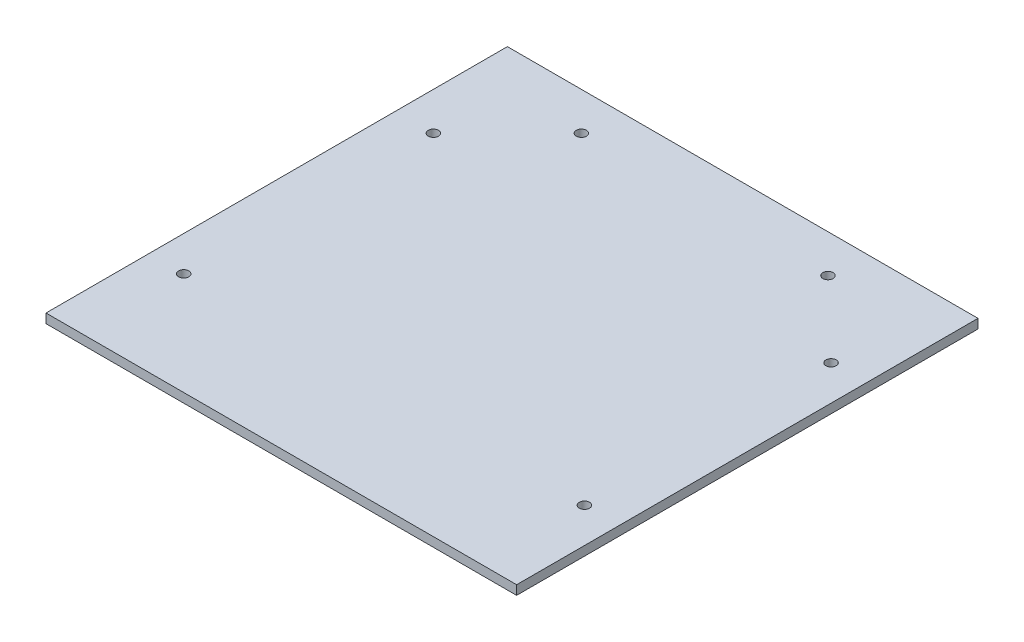
ISO-10303-21;
HEADER;
FILE_DESCRIPTION(('STEP AP214'),'2;1');
FILE_NAME('part.step','',(''),(''),'','','');
FILE_SCHEMA(('AUTOMOTIVE_DESIGN { 1 0 10303 214 1 1 1 1 }'));
ENDSEC;
DATA;
#1=APPLICATION_CONTEXT('core data for automotive mechanical design processes');
#2=APPLICATION_PROTOCOL_DEFINITION('international standard','automotive_design',2000,#1);
#3=PRODUCT_CONTEXT('',#1,'mechanical');
#4=PRODUCT('Part','Part','',(#3));
#5=PRODUCT_RELATED_PRODUCT_CATEGORY('part','',(#4));
#6=PRODUCT_DEFINITION_FORMATION('','',#4);
#7=PRODUCT_DEFINITION_CONTEXT('part definition',#1,'design');
#8=PRODUCT_DEFINITION('design','',#6,#7);
#9=PRODUCT_DEFINITION_SHAPE('','',#8);
#10=(LENGTH_UNIT() NAMED_UNIT(*) SI_UNIT(.MILLI.,.METRE.));
#11=(NAMED_UNIT(*) PLANE_ANGLE_UNIT() SI_UNIT($,.RADIAN.));
#12=(NAMED_UNIT(*) SI_UNIT($,.STERADIAN.) SOLID_ANGLE_UNIT());
#13=UNCERTAINTY_MEASURE_WITH_UNIT(LENGTH_MEASURE(1.E-05),#10,'distance_accuracy_value','');
#14=(GEOMETRIC_REPRESENTATION_CONTEXT(3) GLOBAL_UNCERTAINTY_ASSIGNED_CONTEXT((#13)) GLOBAL_UNIT_ASSIGNED_CONTEXT((#10,
#11,#12)) REPRESENTATION_CONTEXT('',''));
#15=CARTESIAN_POINT('',(0.,0.,0.));
#16=DIRECTION('',(0.,0.,1.));
#17=DIRECTION('',(1.,0.,0.));
#18=AXIS2_PLACEMENT_3D('',#15,#16,#17);
#19=CARTESIAN_POINT('',(114.5,4.5,112.25));
#20=DIRECTION('',(-1.,0.,0.));
#21=DIRECTION('',(0.,0.,1.));
#22=AXIS2_PLACEMENT_3D('',#19,#20,#21);
#23=PLANE('',#22);
#24=DIRECTION('',(0.,0.,-1.));
#25=VECTOR('',#24,1.);
#26=CARTESIAN_POINT('',(114.5,0.,112.25));
#27=LINE('',#26,#25);
#28=CARTESIAN_POINT('',(114.5,0.,112.25));
#29=VERTEX_POINT('',#28);
#30=CARTESIAN_POINT('',(114.5,0.,-112.25));
#31=VERTEX_POINT('',#30);
#32=EDGE_CURVE('E96',#29,#31,#27,.T.);
#33=ORIENTED_EDGE('',*,*,#32,.T.);
#34=DIRECTION('',(0.,-1.,0.));
#35=VECTOR('',#34,1.);
#36=CARTESIAN_POINT('',(114.5,4.5,-112.25));
#37=LINE('',#36,#35);
#38=CARTESIAN_POINT('',(114.5,4.5,-112.25));
#39=VERTEX_POINT('',#38);
#40=EDGE_CURVE('E11',#39,#31,#37,.T.);
#41=ORIENTED_EDGE('',*,*,#40,.F.);
#42=DIRECTION('',(0.,0.,-1.));
#43=VECTOR('',#42,1.);
#44=CARTESIAN_POINT('',(114.5,4.5,112.25));
#45=LINE('',#44,#43);
#46=CARTESIAN_POINT('',(114.5,4.5,112.25));
#47=VERTEX_POINT('',#46);
#48=EDGE_CURVE('E84',#47,#39,#45,.T.);
#49=ORIENTED_EDGE('',*,*,#48,.F.);
#50=DIRECTION('',(0.,-1.,0.));
#51=VECTOR('',#50,1.);
#52=CARTESIAN_POINT('',(114.5,4.5,112.25));
#53=LINE('',#52,#51);
#54=EDGE_CURVE('E92',#47,#29,#53,.T.);
#55=ORIENTED_EDGE('',*,*,#54,.T.);
#56=EDGE_LOOP('',(#33,#41,#49,#55));
#57=FACE_BOUND('',#56,.T.);
#58=ADVANCED_FACE('F33',(#57),#23,.F.);
#59=CARTESIAN_POINT('',(-114.5,4.5,-112.25));
#60=DIRECTION('',(0.,0.,1.));
#61=DIRECTION('',(1.,0.,0.));
#62=AXIS2_PLACEMENT_3D('',#59,#60,#61);
#63=PLANE('',#62);
#64=DIRECTION('',(-1.,0.,0.));
#65=VECTOR('',#64,1.);
#66=CARTESIAN_POINT('',(-114.5,0.,-112.25));
#67=LINE('',#66,#65);
#68=CARTESIAN_POINT('',(-114.5,0.,-112.25));
#69=VERTEX_POINT('',#68);
#70=EDGE_CURVE('E88',#31,#69,#67,.T.);
#71=ORIENTED_EDGE('',*,*,#70,.T.);
#72=DIRECTION('',(0.,-1.,0.));
#73=VECTOR('',#72,1.);
#74=CARTESIAN_POINT('',(-114.5,4.5,-112.25));
#75=LINE('',#74,#73);
#76=CARTESIAN_POINT('',(-114.5,4.5,-112.25));
#77=VERTEX_POINT('',#76);
#78=EDGE_CURVE('E41',#77,#69,#75,.T.);
#79=ORIENTED_EDGE('',*,*,#78,.F.);
#80=DIRECTION('',(-1.,0.,0.));
#81=VECTOR('',#80,1.);
#82=CARTESIAN_POINT('',(-114.5,4.5,-112.25));
#83=LINE('',#82,#81);
#84=EDGE_CURVE('E79',#39,#77,#83,.T.);
#85=ORIENTED_EDGE('',*,*,#84,.F.);
#86=ORIENTED_EDGE('',*,*,#40,.T.);
#87=EDGE_LOOP('',(#71,#79,#85,#86));
#88=FACE_BOUND('',#87,.T.);
#89=ADVANCED_FACE('F87',(#88),#63,.F.);
#90=CARTESIAN_POINT('',(-114.5,4.5,112.25));
#91=DIRECTION('',(1.,0.,0.));
#92=DIRECTION('',(0.,0.,-1.));
#93=AXIS2_PLACEMENT_3D('',#90,#91,#92);
#94=PLANE('',#93);
#95=DIRECTION('',(0.,0.,1.));
#96=VECTOR('',#95,1.);
#97=CARTESIAN_POINT('',(-114.5,0.,112.25));
#98=LINE('',#97,#96);
#99=CARTESIAN_POINT('',(-114.5,0.,112.25));
#100=VERTEX_POINT('',#99);
#101=EDGE_CURVE('E66',#69,#100,#98,.T.);
#102=ORIENTED_EDGE('',*,*,#101,.T.);
#103=DIRECTION('',(0.,-1.,0.));
#104=VECTOR('',#103,1.);
#105=CARTESIAN_POINT('',(-114.5,4.5,112.25));
#106=LINE('',#105,#104);
#107=CARTESIAN_POINT('',(-114.5,4.5,112.25));
#108=VERTEX_POINT('',#107);
#109=EDGE_CURVE('E89',#108,#100,#106,.T.);
#110=ORIENTED_EDGE('',*,*,#109,.F.);
#111=DIRECTION('',(0.,0.,1.));
#112=VECTOR('',#111,1.);
#113=CARTESIAN_POINT('',(-114.5,4.5,112.25));
#114=LINE('',#113,#112);
#115=EDGE_CURVE('E82',#77,#108,#114,.T.);
#116=ORIENTED_EDGE('',*,*,#115,.F.);
#117=ORIENTED_EDGE('',*,*,#78,.T.);
#118=EDGE_LOOP('',(#102,#110,#116,#117));
#119=FACE_BOUND('',#118,.T.);
#120=ADVANCED_FACE('F90',(#119),#94,.F.);
#121=CARTESIAN_POINT('',(-114.5,4.5,112.25));
#122=DIRECTION('',(0.,0.,-1.));
#123=DIRECTION('',(-1.,0.,0.));
#124=AXIS2_PLACEMENT_3D('',#121,#122,#123);
#125=PLANE('',#124);
#126=DIRECTION('',(1.,0.,0.));
#127=VECTOR('',#126,1.);
#128=CARTESIAN_POINT('',(-114.5,0.,112.25));
#129=LINE('',#128,#127);
#130=EDGE_CURVE('E72',#100,#29,#129,.T.);
#131=ORIENTED_EDGE('',*,*,#130,.T.);
#132=ORIENTED_EDGE('',*,*,#54,.F.);
#133=DIRECTION('',(1.,0.,0.));
#134=VECTOR('',#133,1.);
#135=CARTESIAN_POINT('',(-114.5,4.5,112.25));
#136=LINE('',#135,#134);
#137=EDGE_CURVE('E49',#108,#47,#136,.T.);
#138=ORIENTED_EDGE('',*,*,#137,.F.);
#139=ORIENTED_EDGE('',*,*,#109,.T.);
#140=EDGE_LOOP('',(#131,#132,#138,#139));
#141=FACE_BOUND('',#140,.T.);
#142=ADVANCED_FACE('F104',(#141),#125,.F.);
#143=CARTESIAN_POINT('',(0.,4.5,0.));
#144=DIRECTION('',(0.,-1.,0.));
#145=DIRECTION('',(0.,0.,-1.));
#146=AXIS2_PLACEMENT_3D('',#143,#144,#145);
#147=PLANE('',#146);
#148=CARTESIAN_POINT('',(-95.9999999999999,4.5,-57.75));
#149=DIRECTION('',(0.,-1.,0.));
#150=DIRECTION('',(0.,0.,-1.));
#151=AXIS2_PLACEMENT_3D('',#148,#149,#150);
#152=CIRCLE('',#151,2.50000000000001);
#153=CARTESIAN_POINT('',(-95.9999999999999,4.5,-60.25));
#154=VERTEX_POINT('',#153);
#155=EDGE_CURVE('E115',#154,#154,#152,.F.);
#156=ORIENTED_EDGE('',*,*,#155,.F.);
#157=EDGE_LOOP('',(#156));
#158=FACE_BOUND('',#157,.T.);
#159=CARTESIAN_POINT('',(-60.,4.5,-93.75));
#160=DIRECTION('',(0.,-1.,0.));
#161=DIRECTION('',(0.,0.,-1.));
#162=AXIS2_PLACEMENT_3D('',#159,#160,#161);
#163=CIRCLE('',#162,2.5);
#164=CARTESIAN_POINT('',(-60.,4.5,-96.25));
#165=VERTEX_POINT('',#164);
#166=EDGE_CURVE('E135',#165,#165,#163,.F.);
#167=ORIENTED_EDGE('',*,*,#166,.F.);
#168=EDGE_LOOP('',(#167));
#169=FACE_BOUND('',#168,.T.);
#170=CARTESIAN_POINT('',(60.,4.5,-93.7500000000001));
#171=DIRECTION('',(0.,-1.,0.));
#172=DIRECTION('',(0.,0.,-1.));
#173=AXIS2_PLACEMENT_3D('',#170,#171,#172);
#174=CIRCLE('',#173,2.5);
#175=CARTESIAN_POINT('',(60.,4.5,-96.2500000000001));
#176=VERTEX_POINT('',#175);
#177=EDGE_CURVE('E129',#176,#176,#174,.F.);
#178=ORIENTED_EDGE('',*,*,#177,.F.);
#179=EDGE_LOOP('',(#178));
#180=FACE_BOUND('',#179,.T.);
#181=CARTESIAN_POINT('',(97.5,4.5,62.25));
#182=DIRECTION('',(0.,-1.,0.));
#183=DIRECTION('',(0.,0.,-1.));
#184=AXIS2_PLACEMENT_3D('',#181,#182,#183);
#185=CIRCLE('',#184,2.50000000000001);
#186=CARTESIAN_POINT('',(97.5,4.5,59.75));
#187=VERTEX_POINT('',#186);
#188=EDGE_CURVE('E123',#187,#187,#185,.F.);
#189=ORIENTED_EDGE('',*,*,#188,.F.);
#190=EDGE_LOOP('',(#189));
#191=FACE_BOUND('',#190,.T.);
#192=CARTESIAN_POINT('',(97.5,4.5,-57.75));
#193=DIRECTION('',(0.,-1.,0.));
#194=DIRECTION('',(0.,0.,-1.));
#195=AXIS2_PLACEMENT_3D('',#192,#193,#194);
#196=CIRCLE('',#195,2.5);
#197=CARTESIAN_POINT('',(97.5,4.5,-60.25));
#198=VERTEX_POINT('',#197);
#199=EDGE_CURVE('E116',#198,#198,#196,.F.);
#200=ORIENTED_EDGE('',*,*,#199,.F.);
#201=EDGE_LOOP('',(#200));
#202=FACE_BOUND('',#201,.T.);
#203=CARTESIAN_POINT('',(-97.5,4.5,62.25));
#204=DIRECTION('',(0.,-1.,0.));
#205=DIRECTION('',(0.,0.,-1.));
#206=AXIS2_PLACEMENT_3D('',#203,#204,#205);
#207=CIRCLE('',#206,2.5);
#208=CARTESIAN_POINT('',(-97.5,4.5,59.75));
#209=VERTEX_POINT('',#208);
#210=EDGE_CURVE('E99',#209,#209,#207,.F.);
#211=ORIENTED_EDGE('',*,*,#210,.F.);
#212=EDGE_LOOP('',(#211));
#213=FACE_BOUND('',#212,.T.);
#214=ORIENTED_EDGE('',*,*,#48,.T.);
#215=ORIENTED_EDGE('',*,*,#84,.T.);
#216=ORIENTED_EDGE('',*,*,#115,.T.);
#217=ORIENTED_EDGE('',*,*,#137,.T.);
#218=EDGE_LOOP('',(#214,#215,#216,#217));
#219=FACE_BOUND('',#218,.T.);
#220=ADVANCED_FACE('F80',(#158,#169,#180,#191,#202,#213,#219),#147,.F.);
#221=CARTESIAN_POINT('',(0.,0.,0.));
#222=DIRECTION('',(0.,-1.,0.));
#223=DIRECTION('',(0.,0.,-1.));
#224=AXIS2_PLACEMENT_3D('',#221,#222,#223);
#225=PLANE('',#224);
#226=CARTESIAN_POINT('',(-95.9999999999999,0.,-57.75));
#227=DIRECTION('',(0.,-1.,0.));
#228=DIRECTION('',(0.,0.,-1.));
#229=AXIS2_PLACEMENT_3D('',#226,#227,#228);
#230=CIRCLE('',#229,2.50000000000001);
#231=CARTESIAN_POINT('',(-95.9999999999999,0.,-60.25));
#232=VERTEX_POINT('',#231);
#233=EDGE_CURVE('E138',#232,#232,#230,.T.);
#234=ORIENTED_EDGE('',*,*,#233,.F.);
#235=EDGE_LOOP('',(#234));
#236=FACE_BOUND('',#235,.T.);
#237=CARTESIAN_POINT('',(-60.,0.,-93.75));
#238=DIRECTION('',(0.,-1.,0.));
#239=DIRECTION('',(0.,0.,-1.));
#240=AXIS2_PLACEMENT_3D('',#237,#238,#239);
#241=CIRCLE('',#240,2.5);
#242=CARTESIAN_POINT('',(-60.,0.,-96.25));
#243=VERTEX_POINT('',#242);
#244=EDGE_CURVE('E132',#243,#243,#241,.T.);
#245=ORIENTED_EDGE('',*,*,#244,.F.);
#246=EDGE_LOOP('',(#245));
#247=FACE_BOUND('',#246,.T.);
#248=CARTESIAN_POINT('',(60.,0.,-93.7500000000001));
#249=DIRECTION('',(0.,-1.,0.));
#250=DIRECTION('',(0.,0.,-1.));
#251=AXIS2_PLACEMENT_3D('',#248,#249,#250);
#252=CIRCLE('',#251,2.5);
#253=CARTESIAN_POINT('',(60.,0.,-96.2500000000001));
#254=VERTEX_POINT('',#253);
#255=EDGE_CURVE('E126',#254,#254,#252,.T.);
#256=ORIENTED_EDGE('',*,*,#255,.F.);
#257=EDGE_LOOP('',(#256));
#258=FACE_BOUND('',#257,.T.);
#259=CARTESIAN_POINT('',(97.5,0.,62.25));
#260=DIRECTION('',(0.,-1.,0.));
#261=DIRECTION('',(0.,0.,-1.));
#262=AXIS2_PLACEMENT_3D('',#259,#260,#261);
#263=CIRCLE('',#262,2.50000000000001);
#264=CARTESIAN_POINT('',(97.5,0.,59.75));
#265=VERTEX_POINT('',#264);
#266=EDGE_CURVE('E119',#265,#265,#263,.T.);
#267=ORIENTED_EDGE('',*,*,#266,.F.);
#268=EDGE_LOOP('',(#267));
#269=FACE_BOUND('',#268,.T.);
#270=CARTESIAN_POINT('',(97.5,0.,-57.75));
#271=DIRECTION('',(0.,-1.,0.));
#272=DIRECTION('',(0.,0.,-1.));
#273=AXIS2_PLACEMENT_3D('',#270,#271,#272);
#274=CIRCLE('',#273,2.5);
#275=CARTESIAN_POINT('',(97.5,0.,-60.25));
#276=VERTEX_POINT('',#275);
#277=EDGE_CURVE('E120',#276,#276,#274,.T.);
#278=ORIENTED_EDGE('',*,*,#277,.F.);
#279=EDGE_LOOP('',(#278));
#280=FACE_BOUND('',#279,.T.);
#281=CARTESIAN_POINT('',(-97.5,0.,62.25));
#282=DIRECTION('',(0.,-1.,0.));
#283=DIRECTION('',(0.,0.,-1.));
#284=AXIS2_PLACEMENT_3D('',#281,#282,#283);
#285=CIRCLE('',#284,2.5);
#286=CARTESIAN_POINT('',(-97.5,0.,59.75));
#287=VERTEX_POINT('',#286);
#288=EDGE_CURVE('E112',#287,#287,#285,.T.);
#289=ORIENTED_EDGE('',*,*,#288,.F.);
#290=EDGE_LOOP('',(#289));
#291=FACE_BOUND('',#290,.T.);
#292=ORIENTED_EDGE('',*,*,#32,.F.);
#293=ORIENTED_EDGE('',*,*,#130,.F.);
#294=ORIENTED_EDGE('',*,*,#101,.F.);
#295=ORIENTED_EDGE('',*,*,#70,.F.);
#296=EDGE_LOOP('',(#292,#293,#294,#295));
#297=FACE_BOUND('',#296,.T.);
#298=ADVANCED_FACE('F107',(#236,#247,#258,#269,#280,#291,#297),#225,.T.);
#299=CARTESIAN_POINT('',(-97.5,4.501,62.25));
#300=DIRECTION('',(0.,-1.,0.));
#301=DIRECTION('',(0.,0.,-1.));
#302=AXIS2_PLACEMENT_3D('',#299,#300,#301);
#303=CYLINDRICAL_SURFACE('',#302,2.5);
#304=ORIENTED_EDGE('',*,*,#288,.T.);
#305=EDGE_LOOP('',(#304));
#306=FACE_BOUND('',#305,.T.);
#307=ORIENTED_EDGE('',*,*,#210,.T.);
#308=EDGE_LOOP('',(#307));
#309=FACE_BOUND('',#308,.T.);
#310=ADVANCED_FACE('F151',(#306,#309),#303,.F.);
#311=CARTESIAN_POINT('',(97.5,4.501,-57.75));
#312=DIRECTION('',(0.,-1.,0.));
#313=DIRECTION('',(0.,0.,-1.));
#314=AXIS2_PLACEMENT_3D('',#311,#312,#313);
#315=CYLINDRICAL_SURFACE('',#314,2.5);
#316=ORIENTED_EDGE('',*,*,#277,.T.);
#317=EDGE_LOOP('',(#316));
#318=FACE_BOUND('',#317,.T.);
#319=ORIENTED_EDGE('',*,*,#199,.T.);
#320=EDGE_LOOP('',(#319));
#321=FACE_BOUND('',#320,.T.);
#322=ADVANCED_FACE('F165',(#318,#321),#315,.F.);
#323=CARTESIAN_POINT('',(97.5,4.501,62.25));
#324=DIRECTION('',(0.,-1.,0.));
#325=DIRECTION('',(0.,0.,-1.));
#326=AXIS2_PLACEMENT_3D('',#323,#324,#325);
#327=CYLINDRICAL_SURFACE('',#326,2.50000000000001);
#328=ORIENTED_EDGE('',*,*,#266,.T.);
#329=EDGE_LOOP('',(#328));
#330=FACE_BOUND('',#329,.T.);
#331=ORIENTED_EDGE('',*,*,#188,.T.);
#332=EDGE_LOOP('',(#331));
#333=FACE_BOUND('',#332,.T.);
#334=ADVANCED_FACE('F217',(#330,#333),#327,.F.);
#335=CARTESIAN_POINT('',(60.,4.501,-93.7500000000001));
#336=DIRECTION('',(0.,-1.,0.));
#337=DIRECTION('',(0.,0.,-1.));
#338=AXIS2_PLACEMENT_3D('',#335,#336,#337);
#339=CYLINDRICAL_SURFACE('',#338,2.5);
#340=ORIENTED_EDGE('',*,*,#255,.T.);
#341=EDGE_LOOP('',(#340));
#342=FACE_BOUND('',#341,.T.);
#343=ORIENTED_EDGE('',*,*,#177,.T.);
#344=EDGE_LOOP('',(#343));
#345=FACE_BOUND('',#344,.T.);
#346=ADVANCED_FACE('F227',(#342,#345),#339,.F.);
#347=CARTESIAN_POINT('',(-60.,4.501,-93.75));
#348=DIRECTION('',(0.,-1.,0.));
#349=DIRECTION('',(0.,0.,-1.));
#350=AXIS2_PLACEMENT_3D('',#347,#348,#349);
#351=CYLINDRICAL_SURFACE('',#350,2.5);
#352=ORIENTED_EDGE('',*,*,#244,.T.);
#353=EDGE_LOOP('',(#352));
#354=FACE_BOUND('',#353,.T.);
#355=ORIENTED_EDGE('',*,*,#166,.T.);
#356=EDGE_LOOP('',(#355));
#357=FACE_BOUND('',#356,.T.);
#358=ADVANCED_FACE('F237',(#354,#357),#351,.F.);
#359=CARTESIAN_POINT('',(-95.9999999999999,4.501,-57.75));
#360=DIRECTION('',(0.,-1.,0.));
#361=DIRECTION('',(0.,0.,-1.));
#362=AXIS2_PLACEMENT_3D('',#359,#360,#361);
#363=CYLINDRICAL_SURFACE('',#362,2.50000000000001);
#364=ORIENTED_EDGE('',*,*,#233,.T.);
#365=EDGE_LOOP('',(#364));
#366=FACE_BOUND('',#365,.T.);
#367=ORIENTED_EDGE('',*,*,#155,.T.);
#368=EDGE_LOOP('',(#367));
#369=FACE_BOUND('',#368,.T.);
#370=ADVANCED_FACE('F146',(#366,#369),#363,.F.);
#371=CLOSED_SHELL('',(#58,#89,#120,#142,#220,#298,#310,#322,#334,#346,#358,#370));
#372=MANIFOLD_SOLID_BREP('B2',#371);
#373=ADVANCED_BREP_SHAPE_REPRESENTATION('',(#18,#372),#14);
#374=SHAPE_DEFINITION_REPRESENTATION(#9,#373);
ENDSEC;
END-ISO-10303-21;
